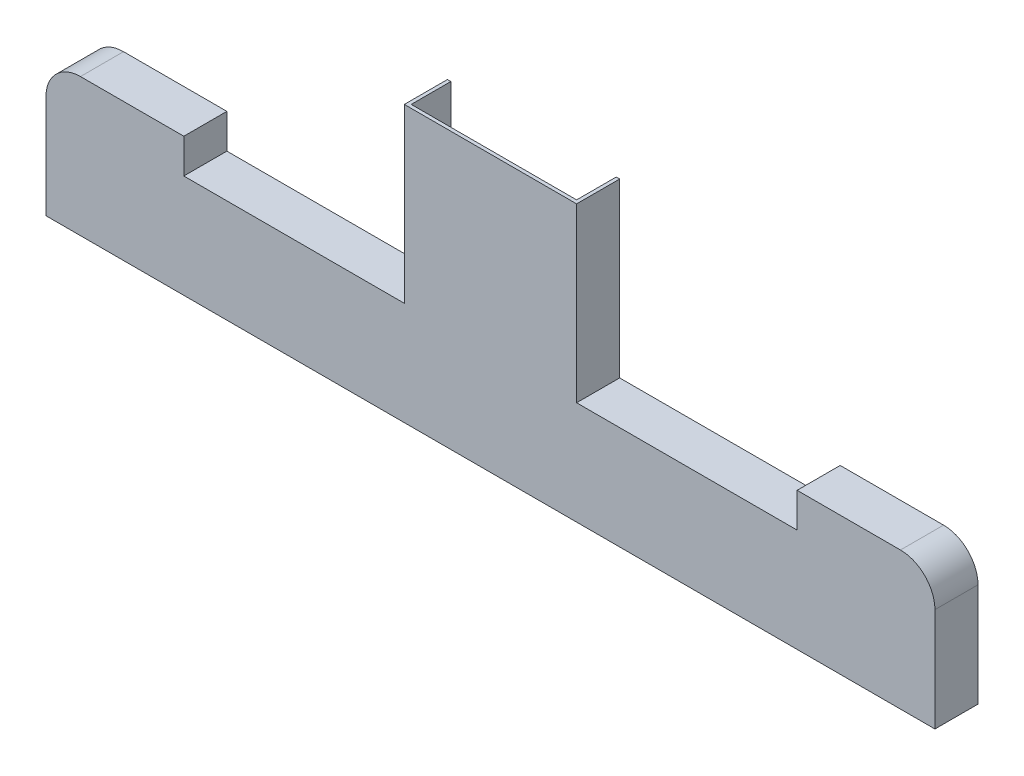
ISO-10303-21;
HEADER;
FILE_DESCRIPTION(('STEP AP214'),'2;1');
FILE_NAME('part.step','',(''),(''),'','','');
FILE_SCHEMA(('AUTOMOTIVE_DESIGN { 1 0 10303 214 1 1 1 1 }'));
ENDSEC;
DATA;
#1=APPLICATION_CONTEXT('core data for automotive mechanical design processes');
#2=APPLICATION_PROTOCOL_DEFINITION('international standard','automotive_design',2000,#1);
#3=PRODUCT_CONTEXT('',#1,'mechanical');
#4=PRODUCT('Part','Part','',(#3));
#5=PRODUCT_RELATED_PRODUCT_CATEGORY('part','',(#4));
#6=PRODUCT_DEFINITION_FORMATION('','',#4);
#7=PRODUCT_DEFINITION_CONTEXT('part definition',#1,'design');
#8=PRODUCT_DEFINITION('design','',#6,#7);
#9=PRODUCT_DEFINITION_SHAPE('','',#8);
#10=(LENGTH_UNIT() NAMED_UNIT(*) SI_UNIT(.MILLI.,.METRE.));
#11=(NAMED_UNIT(*) PLANE_ANGLE_UNIT() SI_UNIT($,.RADIAN.));
#12=(NAMED_UNIT(*) SI_UNIT($,.STERADIAN.) SOLID_ANGLE_UNIT());
#13=UNCERTAINTY_MEASURE_WITH_UNIT(LENGTH_MEASURE(1.E-05),#10,'distance_accuracy_value','');
#14=(GEOMETRIC_REPRESENTATION_CONTEXT(3) GLOBAL_UNCERTAINTY_ASSIGNED_CONTEXT((#13)) GLOBAL_UNIT_ASSIGNED_CONTEXT((#10,
#11,#12)) REPRESENTATION_CONTEXT('',''));
#15=CARTESIAN_POINT('',(0.,0.,0.));
#16=DIRECTION('',(0.,0.,1.));
#17=DIRECTION('',(1.,0.,0.));
#18=AXIS2_PLACEMENT_3D('',#15,#16,#17);
#19=CARTESIAN_POINT('',(20.,60.,-25.));
#20=DIRECTION('',(0.,0.,-1.));
#21=DIRECTION('',(-1.,0.,0.));
#22=AXIS2_PLACEMENT_3D('',#19,#20,#21);
#23=PLANE('',#22);
#24=DIRECTION('',(0.,1.,0.));
#25=VECTOR('',#24,1.);
#26=CARTESIAN_POINT('',(210.,-38.7167665596884,-25.));
#27=LINE('',#26,#25);
#28=CARTESIAN_POINT('',(210.,60.,-25.));
#29=VERTEX_POINT('',#28);
#30=CARTESIAN_POINT('',(210.,160.,-25.));
#31=VERTEX_POINT('',#30);
#32=EDGE_CURVE('E312',#29,#31,#27,.T.);
#33=ORIENTED_EDGE('',*,*,#32,.F.);
#34=DIRECTION('',(1.,0.,0.));
#35=VECTOR('',#34,1.);
#36=CARTESIAN_POINT('',(210.,60.,-25.));
#37=LINE('',#36,#35);
#38=CARTESIAN_POINT('',(306.,60.,-25.));
#39=VERTEX_POINT('',#38);
#40=EDGE_CURVE('E311',#29,#39,#37,.T.);
#41=ORIENTED_EDGE('',*,*,#40,.T.);
#42=DIRECTION('',(0.,1.,0.));
#43=VECTOR('',#42,1.);
#44=CARTESIAN_POINT('',(306.,-38.7167665596883,-25.));
#45=LINE('',#44,#43);
#46=CARTESIAN_POINT('',(306.,160.,-25.));
#47=VERTEX_POINT('',#46);
#48=EDGE_CURVE('E58',#39,#47,#45,.T.);
#49=ORIENTED_EDGE('',*,*,#48,.T.);
#50=DIRECTION('',(-1.,0.,0.));
#51=VECTOR('',#50,1.);
#52=CARTESIAN_POINT('',(208.,160.,-25.));
#53=LINE('',#52,#51);
#54=CARTESIAN_POINT('',(308.,160.,-25.));
#55=VERTEX_POINT('',#54);
#56=EDGE_CURVE('E359',#55,#47,#53,.T.);
#57=ORIENTED_EDGE('',*,*,#56,.F.);
#58=DIRECTION('',(0.,1.,0.));
#59=VECTOR('',#58,1.);
#60=CARTESIAN_POINT('',(308.,60.,-25.));
#61=LINE('',#60,#59);
#62=CARTESIAN_POINT('',(308.,60.,-25.));
#63=VERTEX_POINT('',#62);
#64=EDGE_CURVE('E355',#63,#55,#61,.T.);
#65=ORIENTED_EDGE('',*,*,#64,.F.);
#66=DIRECTION('',(-1.,0.,0.));
#67=VECTOR('',#66,1.);
#68=CARTESIAN_POINT('',(436.,60.,-25.));
#69=LINE('',#68,#67);
#70=CARTESIAN_POINT('',(436.,60.,-25.));
#71=VERTEX_POINT('',#70);
#72=EDGE_CURVE('E352',#71,#63,#69,.T.);
#73=ORIENTED_EDGE('',*,*,#72,.F.);
#74=DIRECTION('',(0.,-1.,0.));
#75=VECTOR('',#74,1.);
#76=CARTESIAN_POINT('',(436.,80.,-25.));
#77=LINE('',#76,#75);
#78=CARTESIAN_POINT('',(436.,80.,-25.));
#79=VERTEX_POINT('',#78);
#80=EDGE_CURVE('E349',#79,#71,#77,.T.);
#81=ORIENTED_EDGE('',*,*,#80,.F.);
#82=DIRECTION('',(-1.,0.,0.));
#83=VECTOR('',#82,1.);
#84=CARTESIAN_POINT('',(496.,80.0000000000001,-25.));
#85=LINE('',#84,#83);
#86=CARTESIAN_POINT('',(496.,80.,-25.));
#87=VERTEX_POINT('',#86);
#88=EDGE_CURVE('E346',#87,#79,#85,.T.);
#89=ORIENTED_EDGE('',*,*,#88,.F.);
#90=CARTESIAN_POINT('',(496.,60.0000000000001,-25.));
#91=DIRECTION('',(0.,0.,1.));
#92=DIRECTION('',(1.,0.,0.));
#93=AXIS2_PLACEMENT_3D('',#90,#91,#92);
#94=CIRCLE('',#93,20.);
#95=CARTESIAN_POINT('',(516.,60.0000000000001,-25.));
#96=VERTEX_POINT('',#95);
#97=EDGE_CURVE('E343',#96,#87,#94,.T.);
#98=ORIENTED_EDGE('',*,*,#97,.F.);
#99=DIRECTION('',(0.,1.,0.));
#100=VECTOR('',#99,1.);
#101=CARTESIAN_POINT('',(516.,1.11022302462516E-13,-25.));
#102=LINE('',#101,#100);
#103=CARTESIAN_POINT('',(516.,1.11022302462516E-13,-25.));
#104=VERTEX_POINT('',#103);
#105=EDGE_CURVE('E340',#104,#96,#102,.T.);
#106=ORIENTED_EDGE('',*,*,#105,.F.);
#107=DIRECTION('',(1.,0.,0.));
#108=VECTOR('',#107,1.);
#109=CARTESIAN_POINT('',(0.,0.,-25.));
#110=LINE('',#109,#108);
#111=CARTESIAN_POINT('',(0.,0.,-25.));
#112=VERTEX_POINT('',#111);
#113=EDGE_CURVE('E336',#112,#104,#110,.T.);
#114=ORIENTED_EDGE('',*,*,#113,.F.);
#115=DIRECTION('',(0.,-1.,0.));
#116=VECTOR('',#115,1.);
#117=CARTESIAN_POINT('',(0.,0.,-25.));
#118=LINE('',#117,#116);
#119=CARTESIAN_POINT('',(0.,60.,-25.));
#120=VERTEX_POINT('',#119);
#121=EDGE_CURVE('E333',#120,#112,#118,.T.);
#122=ORIENTED_EDGE('',*,*,#121,.F.);
#123=CARTESIAN_POINT('',(20.,60.,-25.));
#124=DIRECTION('',(0.,0.,1.));
#125=DIRECTION('',(-1.,0.,0.));
#126=AXIS2_PLACEMENT_3D('',#123,#124,#125);
#127=CIRCLE('',#126,20.);
#128=CARTESIAN_POINT('',(20.,80.,-25.));
#129=VERTEX_POINT('',#128);
#130=EDGE_CURVE('E374',#129,#120,#127,.T.);
#131=ORIENTED_EDGE('',*,*,#130,.F.);
#132=DIRECTION('',(-1.,0.,0.));
#133=VECTOR('',#132,1.);
#134=CARTESIAN_POINT('',(20.,80.,-25.));
#135=LINE('',#134,#133);
#136=CARTESIAN_POINT('',(80.,80.,-25.));
#137=VERTEX_POINT('',#136);
#138=EDGE_CURVE('E371',#137,#129,#135,.T.);
#139=ORIENTED_EDGE('',*,*,#138,.F.);
#140=DIRECTION('',(0.,1.,0.));
#141=VECTOR('',#140,1.);
#142=CARTESIAN_POINT('',(80.,80.,-25.));
#143=LINE('',#142,#141);
#144=CARTESIAN_POINT('',(80.,60.,-25.));
#145=VERTEX_POINT('',#144);
#146=EDGE_CURVE('E368',#145,#137,#143,.T.);
#147=ORIENTED_EDGE('',*,*,#146,.F.);
#148=DIRECTION('',(-1.,0.,0.));
#149=VECTOR('',#148,1.);
#150=CARTESIAN_POINT('',(80.,60.,-25.));
#151=LINE('',#150,#149);
#152=CARTESIAN_POINT('',(208.,60.,-25.));
#153=VERTEX_POINT('',#152);
#154=EDGE_CURVE('E365',#153,#145,#151,.T.);
#155=ORIENTED_EDGE('',*,*,#154,.F.);
#156=DIRECTION('',(0.,-1.,0.));
#157=VECTOR('',#156,1.);
#158=CARTESIAN_POINT('',(208.,60.,-25.));
#159=LINE('',#158,#157);
#160=CARTESIAN_POINT('',(208.,160.,-25.));
#161=VERTEX_POINT('',#160);
#162=EDGE_CURVE('E362',#161,#153,#159,.T.);
#163=ORIENTED_EDGE('',*,*,#162,.F.);
#164=EDGE_CURVE('E358',#31,#161,#53,.T.);
#165=ORIENTED_EDGE('',*,*,#164,.F.);
#166=EDGE_LOOP('',(#33,#41,#49,#57,#65,#73,#81,#89,#98,#106,#114,#122,#131,#139,#147,#155,#163,#165));
#167=FACE_BOUND('',#166,.T.);
#168=DIRECTION('',(-1.,0.,0.));
#169=VECTOR('',#168,1.);
#170=CARTESIAN_POINT('',(436.,58.,-25.));
#171=LINE('',#170,#169);
#172=CARTESIAN_POINT('',(438.,58.,-25.));
#173=VERTEX_POINT('',#172);
#174=CARTESIAN_POINT('',(78.,58.,-25.));
#175=VERTEX_POINT('',#174);
#176=EDGE_CURVE('E292',#173,#175,#171,.T.);
#177=ORIENTED_EDGE('',*,*,#176,.T.);
#178=DIRECTION('',(0.,1.,0.));
#179=VECTOR('',#178,1.);
#180=CARTESIAN_POINT('',(78.,80.,-25.));
#181=LINE('',#180,#179);
#182=CARTESIAN_POINT('',(78.,78.,-25.));
#183=VERTEX_POINT('',#182);
#184=EDGE_CURVE('E289',#175,#183,#181,.T.);
#185=ORIENTED_EDGE('',*,*,#184,.T.);
#186=DIRECTION('',(-1.,0.,0.));
#187=VECTOR('',#186,1.);
#188=CARTESIAN_POINT('',(20.,78.,-25.));
#189=LINE('',#188,#187);
#190=CARTESIAN_POINT('',(20.,78.,-25.));
#191=VERTEX_POINT('',#190);
#192=EDGE_CURVE('E286',#183,#191,#189,.T.);
#193=ORIENTED_EDGE('',*,*,#192,.T.);
#194=CARTESIAN_POINT('',(20.,60.,-25.));
#195=DIRECTION('',(0.,0.,-1.));
#196=DIRECTION('',(-1.,0.,0.));
#197=AXIS2_PLACEMENT_3D('',#194,#195,#196);
#198=CIRCLE('',#197,18.);
#199=CARTESIAN_POINT('',(2.,60.,-25.));
#200=VERTEX_POINT('',#199);
#201=EDGE_CURVE('E50',#191,#200,#198,.F.);
#202=ORIENTED_EDGE('',*,*,#201,.T.);
#203=DIRECTION('',(0.,-1.,0.));
#204=VECTOR('',#203,1.);
#205=CARTESIAN_POINT('',(2.,0.,-25.));
#206=LINE('',#205,#204);
#207=CARTESIAN_POINT('',(2.,2.,-25.));
#208=VERTEX_POINT('',#207);
#209=EDGE_CURVE('E224',#200,#208,#206,.T.);
#210=ORIENTED_EDGE('',*,*,#209,.T.);
#211=DIRECTION('',(1.,0.,0.));
#212=VECTOR('',#211,1.);
#213=CARTESIAN_POINT('',(0.,2.,-25.));
#214=LINE('',#213,#212);
#215=CARTESIAN_POINT('',(514.,2.00000000000011,-25.));
#216=VERTEX_POINT('',#215);
#217=EDGE_CURVE('E244',#208,#216,#214,.T.);
#218=ORIENTED_EDGE('',*,*,#217,.T.);
#219=DIRECTION('',(0.,1.,0.));
#220=VECTOR('',#219,1.);
#221=CARTESIAN_POINT('',(514.,1.07321559047098E-13,-25.));
#222=LINE('',#221,#220);
#223=CARTESIAN_POINT('',(514.,60.0000000000001,-25.));
#224=VERTEX_POINT('',#223);
#225=EDGE_CURVE('E304',#216,#224,#222,.T.);
#226=ORIENTED_EDGE('',*,*,#225,.T.);
#227=CARTESIAN_POINT('',(496.,60.0000000000001,-25.));
#228=DIRECTION('',(0.,0.,-1.));
#229=DIRECTION('',(-1.,0.,0.));
#230=AXIS2_PLACEMENT_3D('',#227,#228,#229);
#231=CIRCLE('',#230,18.);
#232=CARTESIAN_POINT('',(496.,78.0000000000001,-25.));
#233=VERTEX_POINT('',#232);
#234=EDGE_CURVE('E301',#224,#233,#231,.F.);
#235=ORIENTED_EDGE('',*,*,#234,.T.);
#236=DIRECTION('',(-1.,0.,0.));
#237=VECTOR('',#236,1.);
#238=CARTESIAN_POINT('',(496.,78.0000000000001,-25.));
#239=LINE('',#238,#237);
#240=CARTESIAN_POINT('',(438.,78.,-25.));
#241=VERTEX_POINT('',#240);
#242=EDGE_CURVE('E298',#233,#241,#239,.T.);
#243=ORIENTED_EDGE('',*,*,#242,.T.);
#244=DIRECTION('',(0.,-1.,0.));
#245=VECTOR('',#244,1.);
#246=CARTESIAN_POINT('',(438.,80.,-25.));
#247=LINE('',#246,#245);
#248=EDGE_CURVE('E295',#241,#173,#247,.T.);
#249=ORIENTED_EDGE('',*,*,#248,.T.);
#250=EDGE_LOOP('',(#177,#185,#193,#202,#210,#218,#226,#235,#243,#249));
#251=FACE_BOUND('',#250,.T.);
#252=ADVANCED_FACE('F33',(#167,#251),#23,.T.);
#253=CARTESIAN_POINT('',(0.,0.,-25.));
#254=DIRECTION('',(-1.,0.,0.));
#255=DIRECTION('',(0.,0.,1.));
#256=AXIS2_PLACEMENT_3D('',#253,#254,#255);
#257=PLANE('',#256);
#258=DIRECTION('',(0.,-1.,0.));
#259=VECTOR('',#258,1.);
#260=CARTESIAN_POINT('',(0.,0.,0.));
#261=LINE('',#260,#259);
#262=CARTESIAN_POINT('',(0.,60.,0.));
#263=VERTEX_POINT('',#262);
#264=CARTESIAN_POINT('',(0.,0.,0.));
#265=VERTEX_POINT('',#264);
#266=EDGE_CURVE('E332',#263,#265,#261,.T.);
#267=ORIENTED_EDGE('',*,*,#266,.F.);
#268=DIRECTION('',(0.,0.,1.));
#269=VECTOR('',#268,1.);
#270=CARTESIAN_POINT('',(0.,60.,-25.));
#271=LINE('',#270,#269);
#272=EDGE_CURVE('E11',#120,#263,#271,.T.);
#273=ORIENTED_EDGE('',*,*,#272,.F.);
#274=ORIENTED_EDGE('',*,*,#121,.T.);
#275=DIRECTION('',(0.,0.,1.));
#276=VECTOR('',#275,1.);
#277=CARTESIAN_POINT('',(0.,0.,-25.));
#278=LINE('',#277,#276);
#279=EDGE_CURVE('E37',#112,#265,#278,.T.);
#280=ORIENTED_EDGE('',*,*,#279,.T.);
#281=EDGE_LOOP('',(#267,#273,#274,#280));
#282=FACE_BOUND('',#281,.T.);
#283=ADVANCED_FACE('F35',(#282),#257,.T.);
#284=CARTESIAN_POINT('',(20.,60.,-25.));
#285=DIRECTION('',(0.,0.,1.));
#286=DIRECTION('',(1.,0.,0.));
#287=AXIS2_PLACEMENT_3D('',#284,#285,#286);
#288=CYLINDRICAL_SURFACE('',#287,20.);
#289=CARTESIAN_POINT('',(20.,60.,0.));
#290=DIRECTION('',(0.,0.,1.));
#291=DIRECTION('',(-1.,0.,0.));
#292=AXIS2_PLACEMENT_3D('',#289,#290,#291);
#293=CIRCLE('',#292,20.);
#294=CARTESIAN_POINT('',(20.,80.,0.));
#295=VERTEX_POINT('',#294);
#296=EDGE_CURVE('E337',#295,#263,#293,.T.);
#297=ORIENTED_EDGE('',*,*,#296,.F.);
#298=DIRECTION('',(0.,0.,1.));
#299=VECTOR('',#298,1.);
#300=CARTESIAN_POINT('',(20.,80.,-25.));
#301=LINE('',#300,#299);
#302=EDGE_CURVE('E42',#129,#295,#301,.T.);
#303=ORIENTED_EDGE('',*,*,#302,.F.);
#304=ORIENTED_EDGE('',*,*,#130,.T.);
#305=ORIENTED_EDGE('',*,*,#272,.T.);
#306=EDGE_LOOP('',(#297,#303,#304,#305));
#307=FACE_BOUND('',#306,.T.);
#308=ADVANCED_FACE('F451',(#307),#288,.T.);
#309=CARTESIAN_POINT('',(20.,80.,-25.));
#310=DIRECTION('',(0.,1.,0.));
#311=DIRECTION('',(-1.,0.,0.));
#312=AXIS2_PLACEMENT_3D('',#309,#310,#311);
#313=PLANE('',#312);
#314=DIRECTION('',(-1.,0.,0.));
#315=VECTOR('',#314,1.);
#316=CARTESIAN_POINT('',(20.,80.,0.));
#317=LINE('',#316,#315);
#318=CARTESIAN_POINT('',(80.,80.,0.));
#319=VERTEX_POINT('',#318);
#320=EDGE_CURVE('E412',#319,#295,#317,.T.);
#321=ORIENTED_EDGE('',*,*,#320,.F.);
#322=DIRECTION('',(0.,0.,1.));
#323=VECTOR('',#322,1.);
#324=CARTESIAN_POINT('',(80.,80.,-25.));
#325=LINE('',#324,#323);
#326=EDGE_CURVE('E418',#137,#319,#325,.T.);
#327=ORIENTED_EDGE('',*,*,#326,.F.);
#328=ORIENTED_EDGE('',*,*,#138,.T.);
#329=ORIENTED_EDGE('',*,*,#302,.T.);
#330=EDGE_LOOP('',(#321,#327,#328,#329));
#331=FACE_BOUND('',#330,.T.);
#332=ADVANCED_FACE('F499',(#331),#313,.T.);
#333=CARTESIAN_POINT('',(80.,80.,-25.));
#334=DIRECTION('',(1.,0.,0.));
#335=DIRECTION('',(0.,0.,-1.));
#336=AXIS2_PLACEMENT_3D('',#333,#334,#335);
#337=PLANE('',#336);
#338=DIRECTION('',(0.,1.,0.));
#339=VECTOR('',#338,1.);
#340=CARTESIAN_POINT('',(80.,80.,0.));
#341=LINE('',#340,#339);
#342=CARTESIAN_POINT('',(80.,60.,0.));
#343=VERTEX_POINT('',#342);
#344=EDGE_CURVE('E409',#343,#319,#341,.T.);
#345=ORIENTED_EDGE('',*,*,#344,.F.);
#346=DIRECTION('',(0.,0.,1.));
#347=VECTOR('',#346,1.);
#348=CARTESIAN_POINT('',(80.,60.,-25.));
#349=LINE('',#348,#347);
#350=EDGE_CURVE('E420',#145,#343,#349,.T.);
#351=ORIENTED_EDGE('',*,*,#350,.F.);
#352=ORIENTED_EDGE('',*,*,#146,.T.);
#353=ORIENTED_EDGE('',*,*,#326,.T.);
#354=EDGE_LOOP('',(#345,#351,#352,#353));
#355=FACE_BOUND('',#354,.T.);
#356=ADVANCED_FACE('F497',(#355),#337,.T.);
#357=CARTESIAN_POINT('',(80.,60.,-25.));
#358=DIRECTION('',(0.,1.,0.));
#359=DIRECTION('',(0.,0.,1.));
#360=AXIS2_PLACEMENT_3D('',#357,#358,#359);
#361=PLANE('',#360);
#362=DIRECTION('',(-1.,0.,0.));
#363=VECTOR('',#362,1.);
#364=CARTESIAN_POINT('',(80.,60.,0.));
#365=LINE('',#364,#363);
#366=CARTESIAN_POINT('',(208.,60.,0.));
#367=VERTEX_POINT('',#366);
#368=EDGE_CURVE('E406',#367,#343,#365,.T.);
#369=ORIENTED_EDGE('',*,*,#368,.F.);
#370=DIRECTION('',(0.,0.,1.));
#371=VECTOR('',#370,1.);
#372=CARTESIAN_POINT('',(208.,60.,-25.));
#373=LINE('',#372,#371);
#374=EDGE_CURVE('E422',#153,#367,#373,.T.);
#375=ORIENTED_EDGE('',*,*,#374,.F.);
#376=ORIENTED_EDGE('',*,*,#154,.T.);
#377=ORIENTED_EDGE('',*,*,#350,.T.);
#378=EDGE_LOOP('',(#369,#375,#376,#377));
#379=FACE_BOUND('',#378,.T.);
#380=ADVANCED_FACE('F493',(#379),#361,.T.);
#381=CARTESIAN_POINT('',(208.,60.,-25.));
#382=DIRECTION('',(-1.,0.,0.));
#383=DIRECTION('',(0.,0.,1.));
#384=AXIS2_PLACEMENT_3D('',#381,#382,#383);
#385=PLANE('',#384);
#386=DIRECTION('',(0.,-1.,0.));
#387=VECTOR('',#386,1.);
#388=CARTESIAN_POINT('',(208.,60.,0.));
#389=LINE('',#388,#387);
#390=CARTESIAN_POINT('',(208.,160.,0.));
#391=VERTEX_POINT('',#390);
#392=EDGE_CURVE('E403',#391,#367,#389,.T.);
#393=ORIENTED_EDGE('',*,*,#392,.F.);
#394=DIRECTION('',(0.,0.,1.));
#395=VECTOR('',#394,1.);
#396=CARTESIAN_POINT('',(208.,160.,-25.));
#397=LINE('',#396,#395);
#398=EDGE_CURVE('E424',#161,#391,#397,.T.);
#399=ORIENTED_EDGE('',*,*,#398,.F.);
#400=ORIENTED_EDGE('',*,*,#162,.T.);
#401=ORIENTED_EDGE('',*,*,#374,.T.);
#402=EDGE_LOOP('',(#393,#399,#400,#401));
#403=FACE_BOUND('',#402,.T.);
#404=ADVANCED_FACE('F489',(#403),#385,.T.);
#405=CARTESIAN_POINT('',(208.,160.,-25.));
#406=DIRECTION('',(0.,1.,0.));
#407=DIRECTION('',(0.,0.,1.));
#408=AXIS2_PLACEMENT_3D('',#405,#406,#407);
#409=PLANE('',#408);
#410=DIRECTION('',(0.,0.,1.));
#411=VECTOR('',#410,1.);
#412=CARTESIAN_POINT('',(210.,160.,-25.));
#413=LINE('',#412,#411);
#414=CARTESIAN_POINT('',(210.,160.,-2.));
#415=VERTEX_POINT('',#414);
#416=EDGE_CURVE('E226',#31,#415,#413,.T.);
#417=ORIENTED_EDGE('',*,*,#416,.F.);
#418=ORIENTED_EDGE('',*,*,#164,.T.);
#419=ORIENTED_EDGE('',*,*,#398,.T.);
#420=DIRECTION('',(-1.,0.,0.));
#421=VECTOR('',#420,1.);
#422=CARTESIAN_POINT('',(208.,160.,0.));
#423=LINE('',#422,#421);
#424=CARTESIAN_POINT('',(308.,160.,0.));
#425=VERTEX_POINT('',#424);
#426=EDGE_CURVE('E400',#425,#391,#423,.T.);
#427=ORIENTED_EDGE('',*,*,#426,.F.);
#428=DIRECTION('',(0.,0.,1.));
#429=VECTOR('',#428,1.);
#430=CARTESIAN_POINT('',(308.,160.,-25.));
#431=LINE('',#430,#429);
#432=EDGE_CURVE('E426',#55,#425,#431,.T.);
#433=ORIENTED_EDGE('',*,*,#432,.F.);
#434=ORIENTED_EDGE('',*,*,#56,.T.);
#435=DIRECTION('',(0.,0.,-1.));
#436=VECTOR('',#435,1.);
#437=CARTESIAN_POINT('',(306.,160.,-2.));
#438=LINE('',#437,#436);
#439=CARTESIAN_POINT('',(306.,160.,-2.));
#440=VERTEX_POINT('',#439);
#441=EDGE_CURVE('E323',#440,#47,#438,.T.);
#442=ORIENTED_EDGE('',*,*,#441,.F.);
#443=DIRECTION('',(1.,0.,0.));
#444=VECTOR('',#443,1.);
#445=CARTESIAN_POINT('',(210.,160.,-2.));
#446=LINE('',#445,#444);
#447=EDGE_CURVE('E320',#415,#440,#446,.T.);
#448=ORIENTED_EDGE('',*,*,#447,.F.);
#449=EDGE_LOOP('',(#417,#418,#419,#427,#433,#434,#442,#448));
#450=FACE_BOUND('',#449,.T.);
#451=ADVANCED_FACE('F484',(#450),#409,.T.);
#452=CARTESIAN_POINT('',(308.,60.,-25.));
#453=DIRECTION('',(1.,0.,0.));
#454=DIRECTION('',(0.,0.,-1.));
#455=AXIS2_PLACEMENT_3D('',#452,#453,#454);
#456=PLANE('',#455);
#457=DIRECTION('',(0.,1.,0.));
#458=VECTOR('',#457,1.);
#459=CARTESIAN_POINT('',(308.,60.,0.));
#460=LINE('',#459,#458);
#461=CARTESIAN_POINT('',(308.,60.,0.));
#462=VERTEX_POINT('',#461);
#463=EDGE_CURVE('E397',#462,#425,#460,.T.);
#464=ORIENTED_EDGE('',*,*,#463,.F.);
#465=DIRECTION('',(0.,0.,1.));
#466=VECTOR('',#465,1.);
#467=CARTESIAN_POINT('',(308.,60.,-25.));
#468=LINE('',#467,#466);
#469=EDGE_CURVE('E428',#63,#462,#468,.T.);
#470=ORIENTED_EDGE('',*,*,#469,.F.);
#471=ORIENTED_EDGE('',*,*,#64,.T.);
#472=ORIENTED_EDGE('',*,*,#432,.T.);
#473=EDGE_LOOP('',(#464,#470,#471,#472));
#474=FACE_BOUND('',#473,.T.);
#475=ADVANCED_FACE('F479',(#474),#456,.T.);
#476=CARTESIAN_POINT('',(436.,60.,-25.));
#477=DIRECTION('',(0.,1.,0.));
#478=DIRECTION('',(-1.,0.,0.));
#479=AXIS2_PLACEMENT_3D('',#476,#477,#478);
#480=PLANE('',#479);
#481=DIRECTION('',(-1.,0.,0.));
#482=VECTOR('',#481,1.);
#483=CARTESIAN_POINT('',(436.,60.,0.));
#484=LINE('',#483,#482);
#485=CARTESIAN_POINT('',(436.,60.,0.));
#486=VERTEX_POINT('',#485);
#487=EDGE_CURVE('E394',#486,#462,#484,.T.);
#488=ORIENTED_EDGE('',*,*,#487,.F.);
#489=DIRECTION('',(0.,0.,1.));
#490=VECTOR('',#489,1.);
#491=CARTESIAN_POINT('',(436.,60.,-25.));
#492=LINE('',#491,#490);
#493=EDGE_CURVE('E430',#71,#486,#492,.T.);
#494=ORIENTED_EDGE('',*,*,#493,.F.);
#495=ORIENTED_EDGE('',*,*,#72,.T.);
#496=ORIENTED_EDGE('',*,*,#469,.T.);
#497=EDGE_LOOP('',(#488,#494,#495,#496));
#498=FACE_BOUND('',#497,.T.);
#499=ADVANCED_FACE('F475',(#498),#480,.T.);
#500=CARTESIAN_POINT('',(436.,80.,-25.));
#501=DIRECTION('',(-1.,0.,0.));
#502=DIRECTION('',(0.,0.,1.));
#503=AXIS2_PLACEMENT_3D('',#500,#501,#502);
#504=PLANE('',#503);
#505=DIRECTION('',(0.,-1.,0.));
#506=VECTOR('',#505,1.);
#507=CARTESIAN_POINT('',(436.,80.,0.));
#508=LINE('',#507,#506);
#509=CARTESIAN_POINT('',(436.,80.,0.));
#510=VERTEX_POINT('',#509);
#511=EDGE_CURVE('E391',#510,#486,#508,.T.);
#512=ORIENTED_EDGE('',*,*,#511,.F.);
#513=DIRECTION('',(0.,0.,1.));
#514=VECTOR('',#513,1.);
#515=CARTESIAN_POINT('',(436.,80.,-25.));
#516=LINE('',#515,#514);
#517=EDGE_CURVE('E432',#79,#510,#516,.T.);
#518=ORIENTED_EDGE('',*,*,#517,.F.);
#519=ORIENTED_EDGE('',*,*,#80,.T.);
#520=ORIENTED_EDGE('',*,*,#493,.T.);
#521=EDGE_LOOP('',(#512,#518,#519,#520));
#522=FACE_BOUND('',#521,.T.);
#523=ADVANCED_FACE('F471',(#522),#504,.T.);
#524=CARTESIAN_POINT('',(496.,80.0000000000001,-25.));
#525=DIRECTION('',(0.,1.,0.));
#526=DIRECTION('',(-1.,0.,0.));
#527=AXIS2_PLACEMENT_3D('',#524,#525,#526);
#528=PLANE('',#527);
#529=DIRECTION('',(-1.,0.,0.));
#530=VECTOR('',#529,1.);
#531=CARTESIAN_POINT('',(496.,80.0000000000001,0.));
#532=LINE('',#531,#530);
#533=CARTESIAN_POINT('',(496.,80.,0.));
#534=VERTEX_POINT('',#533);
#535=EDGE_CURVE('E388',#534,#510,#532,.T.);
#536=ORIENTED_EDGE('',*,*,#535,.F.);
#537=DIRECTION('',(0.,0.,1.));
#538=VECTOR('',#537,1.);
#539=CARTESIAN_POINT('',(496.,80.,-25.));
#540=LINE('',#539,#538);
#541=EDGE_CURVE('E434',#87,#534,#540,.T.);
#542=ORIENTED_EDGE('',*,*,#541,.F.);
#543=ORIENTED_EDGE('',*,*,#88,.T.);
#544=ORIENTED_EDGE('',*,*,#517,.T.);
#545=EDGE_LOOP('',(#536,#542,#543,#544));
#546=FACE_BOUND('',#545,.T.);
#547=ADVANCED_FACE('F467',(#546),#528,.T.);
#548=CARTESIAN_POINT('',(496.,60.0000000000001,-25.));
#549=DIRECTION('',(0.,0.,1.));
#550=DIRECTION('',(1.,0.,0.));
#551=AXIS2_PLACEMENT_3D('',#548,#549,#550);
#552=CYLINDRICAL_SURFACE('',#551,20.);
#553=CARTESIAN_POINT('',(496.,60.0000000000001,0.));
#554=DIRECTION('',(0.,0.,1.));
#555=DIRECTION('',(1.,0.,0.));
#556=AXIS2_PLACEMENT_3D('',#553,#554,#555);
#557=CIRCLE('',#556,20.);
#558=CARTESIAN_POINT('',(516.,60.0000000000001,0.));
#559=VERTEX_POINT('',#558);
#560=EDGE_CURVE('E385',#559,#534,#557,.T.);
#561=ORIENTED_EDGE('',*,*,#560,.F.);
#562=DIRECTION('',(0.,0.,1.));
#563=VECTOR('',#562,1.);
#564=CARTESIAN_POINT('',(516.,60.0000000000001,-25.));
#565=LINE('',#564,#563);
#566=EDGE_CURVE('E436',#96,#559,#565,.T.);
#567=ORIENTED_EDGE('',*,*,#566,.F.);
#568=ORIENTED_EDGE('',*,*,#97,.T.);
#569=ORIENTED_EDGE('',*,*,#541,.T.);
#570=EDGE_LOOP('',(#561,#567,#568,#569));
#571=FACE_BOUND('',#570,.T.);
#572=ADVANCED_FACE('F465',(#571),#552,.T.);
#573=CARTESIAN_POINT('',(516.,1.11022302462516E-13,-25.));
#574=DIRECTION('',(1.,0.,0.));
#575=DIRECTION('',(0.,1.,0.));
#576=AXIS2_PLACEMENT_3D('',#573,#574,#575);
#577=PLANE('',#576);
#578=DIRECTION('',(0.,1.,0.));
#579=VECTOR('',#578,1.);
#580=CARTESIAN_POINT('',(516.,1.11022302462516E-13,0.));
#581=LINE('',#580,#579);
#582=CARTESIAN_POINT('',(516.,1.11022302462516E-13,0.));
#583=VERTEX_POINT('',#582);
#584=EDGE_CURVE('E382',#583,#559,#581,.T.);
#585=ORIENTED_EDGE('',*,*,#584,.F.);
#586=DIRECTION('',(0.,0.,1.));
#587=VECTOR('',#586,1.);
#588=CARTESIAN_POINT('',(516.,1.11022302462516E-13,-25.));
#589=LINE('',#588,#587);
#590=EDGE_CURVE('E437',#104,#583,#589,.T.);
#591=ORIENTED_EDGE('',*,*,#590,.F.);
#592=ORIENTED_EDGE('',*,*,#105,.T.);
#593=ORIENTED_EDGE('',*,*,#566,.T.);
#594=EDGE_LOOP('',(#585,#591,#592,#593));
#595=FACE_BOUND('',#594,.T.);
#596=ADVANCED_FACE('F461',(#595),#577,.T.);
#597=CARTESIAN_POINT('',(0.,0.,-25.));
#598=DIRECTION('',(0.,-1.,0.));
#599=DIRECTION('',(1.,0.,0.));
#600=AXIS2_PLACEMENT_3D('',#597,#598,#599);
#601=PLANE('',#600);
#602=DIRECTION('',(1.,0.,0.));
#603=VECTOR('',#602,1.);
#604=CARTESIAN_POINT('',(0.,0.,0.));
#605=LINE('',#604,#603);
#606=EDGE_CURVE('E379',#265,#583,#605,.T.);
#607=ORIENTED_EDGE('',*,*,#606,.F.);
#608=ORIENTED_EDGE('',*,*,#279,.F.);
#609=ORIENTED_EDGE('',*,*,#113,.T.);
#610=ORIENTED_EDGE('',*,*,#590,.T.);
#611=EDGE_LOOP('',(#607,#608,#609,#610));
#612=FACE_BOUND('',#611,.T.);
#613=ADVANCED_FACE('F445',(#612),#601,.T.);
#614=CARTESIAN_POINT('',(20.,60.,0.));
#615=DIRECTION('',(0.,0.,-1.));
#616=DIRECTION('',(-1.,0.,0.));
#617=AXIS2_PLACEMENT_3D('',#614,#615,#616);
#618=PLANE('',#617);
#619=ORIENTED_EDGE('',*,*,#266,.T.);
#620=ORIENTED_EDGE('',*,*,#606,.T.);
#621=ORIENTED_EDGE('',*,*,#584,.T.);
#622=ORIENTED_EDGE('',*,*,#560,.T.);
#623=ORIENTED_EDGE('',*,*,#535,.T.);
#624=ORIENTED_EDGE('',*,*,#511,.T.);
#625=ORIENTED_EDGE('',*,*,#487,.T.);
#626=ORIENTED_EDGE('',*,*,#463,.T.);
#627=ORIENTED_EDGE('',*,*,#426,.T.);
#628=ORIENTED_EDGE('',*,*,#392,.T.);
#629=ORIENTED_EDGE('',*,*,#368,.T.);
#630=ORIENTED_EDGE('',*,*,#344,.T.);
#631=ORIENTED_EDGE('',*,*,#320,.T.);
#632=ORIENTED_EDGE('',*,*,#296,.T.);
#633=EDGE_LOOP('',(#619,#620,#621,#622,#623,#624,#625,#626,#627,#628,#629,#630,#631,#632));
#634=FACE_BOUND('',#633,.T.);
#635=ADVANCED_FACE('F447',(#634),#618,.F.);
#636=CARTESIAN_POINT('',(210.,-38.7167665596884,-25.));
#637=DIRECTION('',(-1.,0.,0.));
#638=DIRECTION('',(0.,0.,1.));
#639=AXIS2_PLACEMENT_3D('',#636,#637,#638);
#640=PLANE('',#639);
#641=DIRECTION('',(0.,0.,-1.));
#642=VECTOR('',#641,1.);
#643=CARTESIAN_POINT('',(210.,60.,-25.));
#644=LINE('',#643,#642);
#645=CARTESIAN_POINT('',(210.,60.,-2.));
#646=VERTEX_POINT('',#645);
#647=EDGE_CURVE('E315',#646,#29,#644,.T.);
#648=ORIENTED_EDGE('',*,*,#647,.T.);
#649=ORIENTED_EDGE('',*,*,#32,.T.);
#650=ORIENTED_EDGE('',*,*,#416,.T.);
#651=DIRECTION('',(0.,1.,0.));
#652=VECTOR('',#651,1.);
#653=CARTESIAN_POINT('',(210.,-38.7167665596884,-2.));
#654=LINE('',#653,#652);
#655=EDGE_CURVE('E325',#646,#415,#654,.T.);
#656=ORIENTED_EDGE('',*,*,#655,.F.);
#657=EDGE_LOOP('',(#648,#649,#650,#656));
#658=FACE_BOUND('',#657,.T.);
#659=ADVANCED_FACE('F505',(#658),#640,.F.);
#660=CARTESIAN_POINT('',(306.,-38.7167665596883,-2.));
#661=DIRECTION('',(1.,0.,0.));
#662=DIRECTION('',(0.,1.,0.));
#663=AXIS2_PLACEMENT_3D('',#660,#661,#662);
#664=PLANE('',#663);
#665=DIRECTION('',(0.,0.,1.));
#666=VECTOR('',#665,1.);
#667=CARTESIAN_POINT('',(306.,60.,-2.));
#668=LINE('',#667,#666);
#669=CARTESIAN_POINT('',(306.,60.,-2.));
#670=VERTEX_POINT('',#669);
#671=EDGE_CURVE('E309',#39,#670,#668,.T.);
#672=ORIENTED_EDGE('',*,*,#671,.T.);
#673=DIRECTION('',(0.,1.,0.));
#674=VECTOR('',#673,1.);
#675=CARTESIAN_POINT('',(306.,-38.7167665596883,-2.));
#676=LINE('',#675,#674);
#677=EDGE_CURVE('E328',#670,#440,#676,.T.);
#678=ORIENTED_EDGE('',*,*,#677,.T.);
#679=ORIENTED_EDGE('',*,*,#441,.T.);
#680=ORIENTED_EDGE('',*,*,#48,.F.);
#681=EDGE_LOOP('',(#672,#678,#679,#680));
#682=FACE_BOUND('',#681,.T.);
#683=ADVANCED_FACE('F511',(#682),#664,.F.);
#684=CARTESIAN_POINT('',(210.,-38.7167665596884,-2.));
#685=DIRECTION('',(0.,0.,1.));
#686=DIRECTION('',(1.,0.,0.));
#687=AXIS2_PLACEMENT_3D('',#684,#685,#686);
#688=PLANE('',#687);
#689=DIRECTION('',(-1.,0.,0.));
#690=VECTOR('',#689,1.);
#691=CARTESIAN_POINT('',(210.,60.,-2.));
#692=LINE('',#691,#690);
#693=EDGE_CURVE('E317',#670,#646,#692,.T.);
#694=ORIENTED_EDGE('',*,*,#693,.T.);
#695=ORIENTED_EDGE('',*,*,#655,.T.);
#696=ORIENTED_EDGE('',*,*,#447,.T.);
#697=ORIENTED_EDGE('',*,*,#677,.F.);
#698=EDGE_LOOP('',(#694,#695,#696,#697));
#699=FACE_BOUND('',#698,.T.);
#700=ADVANCED_FACE('F514',(#699),#688,.F.);
#701=CARTESIAN_POINT('',(80.,60.,-25.));
#702=DIRECTION('',(0.,1.,0.));
#703=DIRECTION('',(0.,0.,1.));
#704=AXIS2_PLACEMENT_3D('',#701,#702,#703);
#705=PLANE('',#704);
#706=ORIENTED_EDGE('',*,*,#647,.F.);
#707=ORIENTED_EDGE('',*,*,#693,.F.);
#708=ORIENTED_EDGE('',*,*,#671,.F.);
#709=ORIENTED_EDGE('',*,*,#40,.F.);
#710=EDGE_LOOP('',(#706,#707,#708,#709));
#711=FACE_BOUND('',#710,.T.);
#712=ADVANCED_FACE('F510',(#711),#705,.T.);
#713=CARTESIAN_POINT('',(2.,0.,-25.));
#714=DIRECTION('',(-1.,0.,0.));
#715=DIRECTION('',(0.,0.,1.));
#716=AXIS2_PLACEMENT_3D('',#713,#714,#715);
#717=PLANE('',#716);
#718=DIRECTION('',(0.,-1.,0.));
#719=VECTOR('',#718,1.);
#720=CARTESIAN_POINT('',(2.,0.,-2.));
#721=LINE('',#720,#719);
#722=CARTESIAN_POINT('',(1.99999999999999,60.,-2.));
#723=VERTEX_POINT('',#722);
#724=CARTESIAN_POINT('',(2.,2.,-2.));
#725=VERTEX_POINT('',#724);
#726=EDGE_CURVE('E222',#723,#725,#721,.T.);
#727=ORIENTED_EDGE('',*,*,#726,.T.);
#728=DIRECTION('',(0.,0.,1.));
#729=VECTOR('',#728,1.);
#730=CARTESIAN_POINT('',(2.,2.,-25.));
#731=LINE('',#730,#729);
#732=EDGE_CURVE('E250',#208,#725,#731,.T.);
#733=ORIENTED_EDGE('',*,*,#732,.F.);
#734=ORIENTED_EDGE('',*,*,#209,.F.);
#735=DIRECTION('',(0.,0.,1.));
#736=VECTOR('',#735,1.);
#737=CARTESIAN_POINT('',(1.99999999999999,60.,-25.));
#738=LINE('',#737,#736);
#739=EDGE_CURVE('E219',#200,#723,#738,.T.);
#740=ORIENTED_EDGE('',*,*,#739,.T.);
#741=EDGE_LOOP('',(#727,#733,#734,#740));
#742=FACE_BOUND('',#741,.T.);
#743=ADVANCED_FACE('F221',(#742),#717,.F.);
#744=CARTESIAN_POINT('',(20.,60.,-25.));
#745=DIRECTION('',(0.,0.,1.));
#746=DIRECTION('',(1.,0.,0.));
#747=AXIS2_PLACEMENT_3D('',#744,#745,#746);
#748=CYLINDRICAL_SURFACE('',#747,18.);
#749=CARTESIAN_POINT('',(20.,60.,-2.));
#750=DIRECTION('',(0.,0.,-1.));
#751=DIRECTION('',(-1.,0.,0.));
#752=AXIS2_PLACEMENT_3D('',#749,#750,#751);
#753=CIRCLE('',#752,18.);
#754=CARTESIAN_POINT('',(20.,78.,-2.));
#755=VERTEX_POINT('',#754);
#756=EDGE_CURVE('E235',#755,#723,#753,.F.);
#757=ORIENTED_EDGE('',*,*,#756,.T.);
#758=ORIENTED_EDGE('',*,*,#739,.F.);
#759=ORIENTED_EDGE('',*,*,#201,.F.);
#760=DIRECTION('',(0.,0.,1.));
#761=VECTOR('',#760,1.);
#762=CARTESIAN_POINT('',(20.,78.,-25.));
#763=LINE('',#762,#761);
#764=EDGE_CURVE('E227',#191,#755,#763,.T.);
#765=ORIENTED_EDGE('',*,*,#764,.T.);
#766=EDGE_LOOP('',(#757,#758,#759,#765));
#767=FACE_BOUND('',#766,.T.);
#768=ADVANCED_FACE('F240',(#767),#748,.F.);
#769=CARTESIAN_POINT('',(20.,78.,-25.));
#770=DIRECTION('',(0.,1.,0.));
#771=DIRECTION('',(-1.,0.,0.));
#772=AXIS2_PLACEMENT_3D('',#769,#770,#771);
#773=PLANE('',#772);
#774=DIRECTION('',(-1.,0.,0.));
#775=VECTOR('',#774,1.);
#776=CARTESIAN_POINT('',(20.,78.,-2.));
#777=LINE('',#776,#775);
#778=CARTESIAN_POINT('',(78.,78.,-2.));
#779=VERTEX_POINT('',#778);
#780=EDGE_CURVE('E242',#779,#755,#777,.T.);
#781=ORIENTED_EDGE('',*,*,#780,.T.);
#782=ORIENTED_EDGE('',*,*,#764,.F.);
#783=ORIENTED_EDGE('',*,*,#192,.F.);
#784=DIRECTION('',(0.,0.,1.));
#785=VECTOR('',#784,1.);
#786=CARTESIAN_POINT('',(78.,78.,-25.));
#787=LINE('',#786,#785);
#788=EDGE_CURVE('E251',#183,#779,#787,.T.);
#789=ORIENTED_EDGE('',*,*,#788,.T.);
#790=EDGE_LOOP('',(#781,#782,#783,#789));
#791=FACE_BOUND('',#790,.T.);
#792=ADVANCED_FACE('F605',(#791),#773,.F.);
#793=CARTESIAN_POINT('',(78.,80.,-25.));
#794=DIRECTION('',(1.,0.,0.));
#795=DIRECTION('',(0.,0.,-1.));
#796=AXIS2_PLACEMENT_3D('',#793,#794,#795);
#797=PLANE('',#796);
#798=DIRECTION('',(0.,1.,0.));
#799=VECTOR('',#798,1.);
#800=CARTESIAN_POINT('',(78.,80.,-2.));
#801=LINE('',#800,#799);
#802=CARTESIAN_POINT('',(78.,58.,-2.));
#803=VERTEX_POINT('',#802);
#804=EDGE_CURVE('E246',#803,#779,#801,.T.);
#805=ORIENTED_EDGE('',*,*,#804,.T.);
#806=ORIENTED_EDGE('',*,*,#788,.F.);
#807=ORIENTED_EDGE('',*,*,#184,.F.);
#808=DIRECTION('',(0.,0.,1.));
#809=VECTOR('',#808,1.);
#810=CARTESIAN_POINT('',(78.,58.,-25.));
#811=LINE('',#810,#809);
#812=EDGE_CURVE('E254',#175,#803,#811,.T.);
#813=ORIENTED_EDGE('',*,*,#812,.T.);
#814=EDGE_LOOP('',(#805,#806,#807,#813));
#815=FACE_BOUND('',#814,.T.);
#816=ADVANCED_FACE('F614',(#815),#797,.F.);
#817=CARTESIAN_POINT('',(80.,58.,-25.));
#818=DIRECTION('',(0.,1.,0.));
#819=DIRECTION('',(0.,0.,1.));
#820=AXIS2_PLACEMENT_3D('',#817,#818,#819);
#821=PLANE('',#820);
#822=ORIENTED_EDGE('',*,*,#176,.F.);
#823=DIRECTION('',(0.,0.,1.));
#824=VECTOR('',#823,1.);
#825=CARTESIAN_POINT('',(438.,58.,-25.));
#826=LINE('',#825,#824);
#827=CARTESIAN_POINT('',(438.,58.,-2.));
#828=VERTEX_POINT('',#827);
#829=EDGE_CURVE('E260',#173,#828,#826,.T.);
#830=ORIENTED_EDGE('',*,*,#829,.T.);
#831=DIRECTION('',(-1.,0.,0.));
#832=VECTOR('',#831,1.);
#833=CARTESIAN_POINT('',(80.,58.,-2.));
#834=LINE('',#833,#832);
#835=EDGE_CURVE('E257',#828,#803,#834,.T.);
#836=ORIENTED_EDGE('',*,*,#835,.T.);
#837=ORIENTED_EDGE('',*,*,#812,.F.);
#838=EDGE_LOOP('',(#822,#830,#836,#837));
#839=FACE_BOUND('',#838,.T.);
#840=ADVANCED_FACE('F624',(#839),#821,.F.);
#841=CARTESIAN_POINT('',(438.,80.,-25.));
#842=DIRECTION('',(-1.,0.,0.));
#843=DIRECTION('',(0.,0.,1.));
#844=AXIS2_PLACEMENT_3D('',#841,#842,#843);
#845=PLANE('',#844);
#846=DIRECTION('',(0.,-1.,0.));
#847=VECTOR('',#846,1.);
#848=CARTESIAN_POINT('',(438.,80.,-2.));
#849=LINE('',#848,#847);
#850=CARTESIAN_POINT('',(438.,78.,-2.));
#851=VERTEX_POINT('',#850);
#852=EDGE_CURVE('E262',#851,#828,#849,.T.);
#853=ORIENTED_EDGE('',*,*,#852,.T.);
#854=ORIENTED_EDGE('',*,*,#829,.F.);
#855=ORIENTED_EDGE('',*,*,#248,.F.);
#856=DIRECTION('',(0.,0.,1.));
#857=VECTOR('',#856,1.);
#858=CARTESIAN_POINT('',(438.,78.,-25.));
#859=LINE('',#858,#857);
#860=EDGE_CURVE('E265',#241,#851,#859,.T.);
#861=ORIENTED_EDGE('',*,*,#860,.T.);
#862=EDGE_LOOP('',(#853,#854,#855,#861));
#863=FACE_BOUND('',#862,.T.);
#864=ADVANCED_FACE('F635',(#863),#845,.F.);
#865=CARTESIAN_POINT('',(496.,78.0000000000001,-25.));
#866=DIRECTION('',(0.,1.,0.));
#867=DIRECTION('',(-1.,0.,0.));
#868=AXIS2_PLACEMENT_3D('',#865,#866,#867);
#869=PLANE('',#868);
#870=DIRECTION('',(-1.,0.,0.));
#871=VECTOR('',#870,1.);
#872=CARTESIAN_POINT('',(496.,78.0000000000001,-2.));
#873=LINE('',#872,#871);
#874=CARTESIAN_POINT('',(496.,78.,-2.));
#875=VERTEX_POINT('',#874);
#876=EDGE_CURVE('E268',#875,#851,#873,.T.);
#877=ORIENTED_EDGE('',*,*,#876,.T.);
#878=ORIENTED_EDGE('',*,*,#860,.F.);
#879=ORIENTED_EDGE('',*,*,#242,.F.);
#880=DIRECTION('',(0.,0.,1.));
#881=VECTOR('',#880,1.);
#882=CARTESIAN_POINT('',(496.,78.,-25.));
#883=LINE('',#882,#881);
#884=EDGE_CURVE('E270',#233,#875,#883,.T.);
#885=ORIENTED_EDGE('',*,*,#884,.T.);
#886=EDGE_LOOP('',(#877,#878,#879,#885));
#887=FACE_BOUND('',#886,.T.);
#888=ADVANCED_FACE('F646',(#887),#869,.F.);
#889=CARTESIAN_POINT('',(496.,60.0000000000001,-25.));
#890=DIRECTION('',(0.,0.,1.));
#891=DIRECTION('',(1.,0.,0.));
#892=AXIS2_PLACEMENT_3D('',#889,#890,#891);
#893=CYLINDRICAL_SURFACE('',#892,18.);
#894=CARTESIAN_POINT('',(496.,60.0000000000001,-2.));
#895=DIRECTION('',(0.,0.,-1.));
#896=DIRECTION('',(-1.,0.,0.));
#897=AXIS2_PLACEMENT_3D('',#894,#895,#896);
#898=CIRCLE('',#897,18.);
#899=CARTESIAN_POINT('',(514.,60.0000000000001,-2.));
#900=VERTEX_POINT('',#899);
#901=EDGE_CURVE('E273',#900,#875,#898,.F.);
#902=ORIENTED_EDGE('',*,*,#901,.T.);
#903=ORIENTED_EDGE('',*,*,#884,.F.);
#904=ORIENTED_EDGE('',*,*,#234,.F.);
#905=DIRECTION('',(0.,0.,1.));
#906=VECTOR('',#905,1.);
#907=CARTESIAN_POINT('',(514.,60.0000000000001,-25.));
#908=LINE('',#907,#906);
#909=EDGE_CURVE('E275',#224,#900,#908,.T.);
#910=ORIENTED_EDGE('',*,*,#909,.T.);
#911=EDGE_LOOP('',(#902,#903,#904,#910));
#912=FACE_BOUND('',#911,.T.);
#913=ADVANCED_FACE('F656',(#912),#893,.F.);
#914=CARTESIAN_POINT('',(514.,1.07321559047098E-13,-25.));
#915=DIRECTION('',(1.,0.,0.));
#916=DIRECTION('',(0.,1.,0.));
#917=AXIS2_PLACEMENT_3D('',#914,#915,#916);
#918=PLANE('',#917);
#919=DIRECTION('',(0.,1.,0.));
#920=VECTOR('',#919,1.);
#921=CARTESIAN_POINT('',(514.,1.07321559047098E-13,-2.));
#922=LINE('',#921,#920);
#923=CARTESIAN_POINT('',(514.,2.00000000000011,-2.));
#924=VERTEX_POINT('',#923);
#925=EDGE_CURVE('E278',#924,#900,#922,.T.);
#926=ORIENTED_EDGE('',*,*,#925,.T.);
#927=ORIENTED_EDGE('',*,*,#909,.F.);
#928=ORIENTED_EDGE('',*,*,#225,.F.);
#929=DIRECTION('',(0.,0.,1.));
#930=VECTOR('',#929,1.);
#931=CARTESIAN_POINT('',(514.,2.00000000000011,-25.));
#932=LINE('',#931,#930);
#933=EDGE_CURVE('E280',#216,#924,#932,.T.);
#934=ORIENTED_EDGE('',*,*,#933,.T.);
#935=EDGE_LOOP('',(#926,#927,#928,#934));
#936=FACE_BOUND('',#935,.T.);
#937=ADVANCED_FACE('F666',(#936),#918,.F.);
#938=CARTESIAN_POINT('',(0.,2.,-25.));
#939=DIRECTION('',(0.,-1.,0.));
#940=DIRECTION('',(1.,0.,0.));
#941=AXIS2_PLACEMENT_3D('',#938,#939,#940);
#942=PLANE('',#941);
#943=DIRECTION('',(1.,0.,0.));
#944=VECTOR('',#943,1.);
#945=CARTESIAN_POINT('',(0.,2.,-2.));
#946=LINE('',#945,#944);
#947=EDGE_CURVE('E238',#725,#924,#946,.T.);
#948=ORIENTED_EDGE('',*,*,#947,.T.);
#949=ORIENTED_EDGE('',*,*,#933,.F.);
#950=ORIENTED_EDGE('',*,*,#217,.F.);
#951=ORIENTED_EDGE('',*,*,#732,.T.);
#952=EDGE_LOOP('',(#948,#949,#950,#951));
#953=FACE_BOUND('',#952,.T.);
#954=ADVANCED_FACE('F676',(#953),#942,.F.);
#955=CARTESIAN_POINT('',(20.,60.,-2.));
#956=DIRECTION('',(0.,0.,-1.));
#957=DIRECTION('',(-1.,0.,0.));
#958=AXIS2_PLACEMENT_3D('',#955,#956,#957);
#959=PLANE('',#958);
#960=ORIENTED_EDGE('',*,*,#852,.F.);
#961=ORIENTED_EDGE('',*,*,#876,.F.);
#962=ORIENTED_EDGE('',*,*,#901,.F.);
#963=ORIENTED_EDGE('',*,*,#925,.F.);
#964=ORIENTED_EDGE('',*,*,#947,.F.);
#965=ORIENTED_EDGE('',*,*,#726,.F.);
#966=ORIENTED_EDGE('',*,*,#756,.F.);
#967=ORIENTED_EDGE('',*,*,#780,.F.);
#968=ORIENTED_EDGE('',*,*,#804,.F.);
#969=ORIENTED_EDGE('',*,*,#835,.F.);
#970=EDGE_LOOP('',(#960,#961,#962,#963,#964,#965,#966,#967,#968,#969));
#971=FACE_BOUND('',#970,.T.);
#972=ADVANCED_FACE('F233',(#971),#959,.T.);
#973=CLOSED_SHELL('',(#252,#283,#308,#332,#356,#380,#404,#451,#475,#499,#523,#547,#572,#596,
#613,#635,#659,#683,#700,#712,#743,#768,#792,#816,#840,#864,#888,#913,#937,#954,#972));
#974=MANIFOLD_SOLID_BREP('B2',#973);
#975=ADVANCED_BREP_SHAPE_REPRESENTATION('',(#18,#974),#14);
#976=SHAPE_DEFINITION_REPRESENTATION(#9,#975);
ENDSEC;
END-ISO-10303-21;
